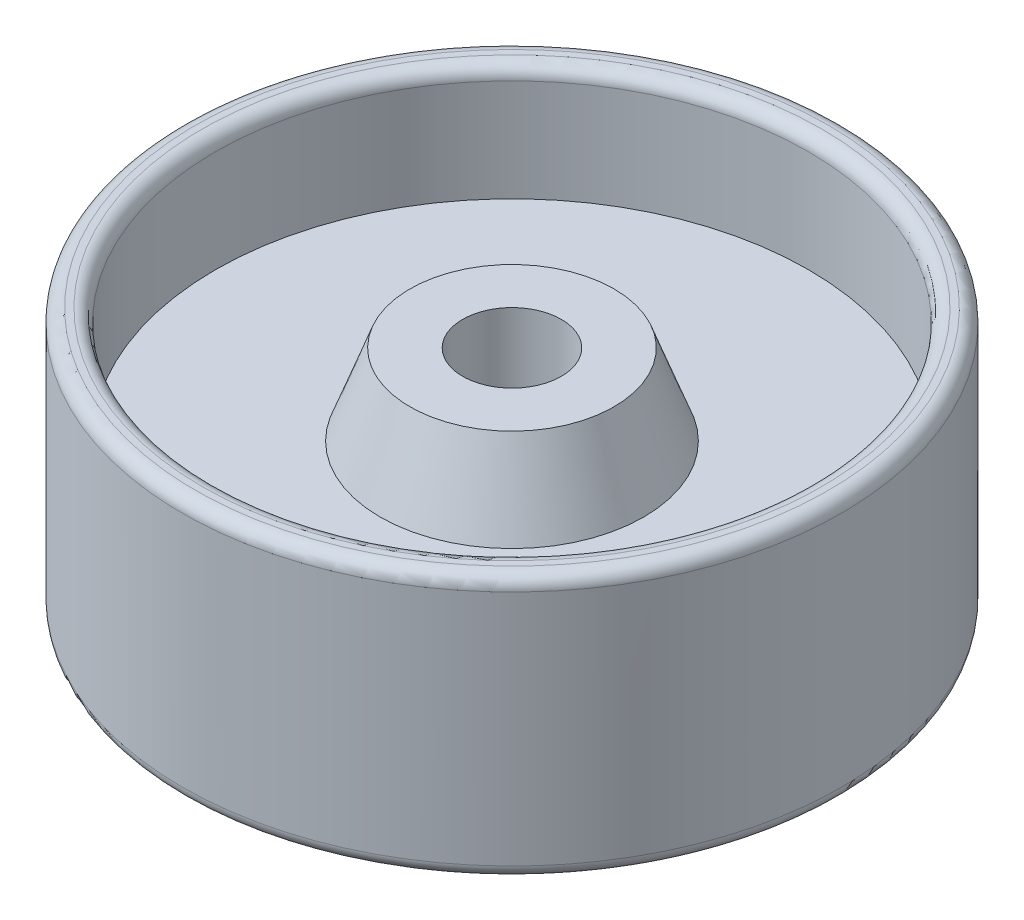
ISO-10303-21;
HEADER;
FILE_DESCRIPTION(('STEP AP214'),'2;1');
FILE_NAME('part.step','',(''),(''),'','','');
FILE_SCHEMA(('AUTOMOTIVE_DESIGN { 1 0 10303 214 1 1 1 1 }'));
ENDSEC;
DATA;
#1=APPLICATION_CONTEXT('core data for automotive mechanical design processes');
#2=APPLICATION_PROTOCOL_DEFINITION('international standard','automotive_design',2000,#1);
#3=PRODUCT_CONTEXT('',#1,'mechanical');
#4=PRODUCT('Part','Part','',(#3));
#5=PRODUCT_RELATED_PRODUCT_CATEGORY('part','',(#4));
#6=PRODUCT_DEFINITION_FORMATION('','',#4);
#7=PRODUCT_DEFINITION_CONTEXT('part definition',#1,'design');
#8=PRODUCT_DEFINITION('design','',#6,#7);
#9=PRODUCT_DEFINITION_SHAPE('','',#8);
#10=(LENGTH_UNIT() NAMED_UNIT(*) SI_UNIT(.MILLI.,.METRE.));
#11=(NAMED_UNIT(*) PLANE_ANGLE_UNIT() SI_UNIT($,.RADIAN.));
#12=(NAMED_UNIT(*) SI_UNIT($,.STERADIAN.) SOLID_ANGLE_UNIT());
#13=UNCERTAINTY_MEASURE_WITH_UNIT(LENGTH_MEASURE(1.E-05),#10,'distance_accuracy_value','');
#14=(GEOMETRIC_REPRESENTATION_CONTEXT(3) GLOBAL_UNCERTAINTY_ASSIGNED_CONTEXT((#13)) GLOBAL_UNIT_ASSIGNED_CONTEXT((#10,
#11,#12)) REPRESENTATION_CONTEXT('',''));
#15=CARTESIAN_POINT('',(0.,0.,0.));
#16=DIRECTION('',(0.,0.,1.));
#17=DIRECTION('',(1.,0.,0.));
#18=AXIS2_PLACEMENT_3D('',#15,#16,#17);
#19=CARTESIAN_POINT('',(0.,25.4,0.));
#20=DIRECTION('',(0.,-1.,0.));
#21=DIRECTION('',(0.,0.,-1.));
#22=AXIS2_PLACEMENT_3D('',#19,#20,#21);
#23=PLANE('',#22);
#24=CARTESIAN_POINT('',(63.5,25.4,0.));
#25=DIRECTION('',(0.,-1.,0.));
#26=DIRECTION('',(0.,0.,-1.));
#27=AXIS2_PLACEMENT_3D('',#24,#25,#26);
#28=CIRCLE('',#27,59.69);
#29=CARTESIAN_POINT('',(63.5,25.4,-59.69));
#30=VERTEX_POINT('',#29);
#31=EDGE_CURVE('E65',#30,#30,#28,.T.);
#32=ORIENTED_EDGE('',*,*,#31,.T.);
#33=EDGE_LOOP('',(#32));
#34=FACE_BOUND('',#33,.T.);
#35=CARTESIAN_POINT('',(63.5,25.4,0.));
#36=DIRECTION('',(0.,-1.,0.));
#37=DIRECTION('',(0.,0.,-1.));
#38=AXIS2_PLACEMENT_3D('',#35,#36,#37);
#39=CIRCLE('',#38,60.96);
#40=CARTESIAN_POINT('',(63.5,25.4,-60.96));
#41=VERTEX_POINT('',#40);
#42=EDGE_CURVE('E69',#41,#41,#39,.F.);
#43=ORIENTED_EDGE('',*,*,#42,.T.);
#44=EDGE_LOOP('',(#43));
#45=FACE_BOUND('',#44,.T.);
#46=ADVANCED_FACE('F41',(#34,#45),#23,.F.);
#47=CARTESIAN_POINT('',(63.5,0.,0.));
#48=DIRECTION('',(0.,-1.,0.));
#49=DIRECTION('',(0.,0.,-1.));
#50=AXIS2_PLACEMENT_3D('',#47,#48,#49);
#51=CYLINDRICAL_SURFACE('',#50,57.15);
#52=CARTESIAN_POINT('',(63.5,22.86,0.));
#53=DIRECTION('',(0.,-1.,0.));
#54=DIRECTION('',(0.,0.,-1.));
#55=AXIS2_PLACEMENT_3D('',#52,#53,#54);
#56=CIRCLE('',#55,57.15);
#57=CARTESIAN_POINT('',(63.5,22.86,-57.15));
#58=VERTEX_POINT('',#57);
#59=EDGE_CURVE('E59',#58,#58,#56,.F.);
#60=ORIENTED_EDGE('',*,*,#59,.T.);
#61=EDGE_LOOP('',(#60));
#62=FACE_BOUND('',#61,.T.);
#63=CARTESIAN_POINT('',(63.5,3.175,0.));
#64=DIRECTION('',(0.,-1.,0.));
#65=DIRECTION('',(0.,0.,-1.));
#66=AXIS2_PLACEMENT_3D('',#63,#64,#65);
#67=CIRCLE('',#66,57.15);
#68=CARTESIAN_POINT('',(63.5,3.175,-57.15));
#69=VERTEX_POINT('',#68);
#70=EDGE_CURVE('E73',#69,#69,#67,.T.);
#71=ORIENTED_EDGE('',*,*,#70,.T.);
#72=EDGE_LOOP('',(#71));
#73=FACE_BOUND('',#72,.T.);
#74=ADVANCED_FACE('F126',(#62,#73),#51,.F.);
#75=CARTESIAN_POINT('',(6.35,3.17500000000001,0.));
#76=DIRECTION('',(0.,-1.,0.));
#77=DIRECTION('',(0.,0.,-1.));
#78=AXIS2_PLACEMENT_3D('',#75,#76,#77);
#79=PLANE('',#78);
#80=ORIENTED_EDGE('',*,*,#70,.F.);
#81=EDGE_LOOP('',(#80));
#82=FACE_BOUND('',#81,.T.);
#83=CARTESIAN_POINT('',(63.5,3.17500000000001,0.));
#84=DIRECTION('',(0.,-1.,0.));
#85=DIRECTION('',(0.,0.,-1.));
#86=AXIS2_PLACEMENT_3D('',#83,#84,#85);
#87=CIRCLE('',#86,25.4);
#88=CARTESIAN_POINT('',(63.5,3.17500000000001,-25.4));
#89=VERTEX_POINT('',#88);
#90=EDGE_CURVE('E77',#89,#89,#87,.T.);
#91=ORIENTED_EDGE('',*,*,#90,.T.);
#92=EDGE_LOOP('',(#91));
#93=FACE_BOUND('',#92,.T.);
#94=ADVANCED_FACE('F132',(#82,#93),#79,.F.);
#95=CARTESIAN_POINT('',(63.5,18.7159459040965,0.));
#96=DIRECTION('',(0.,-1.,0.));
#97=DIRECTION('',(0.,0.,-1.));
#98=AXIS2_PLACEMENT_3D('',#95,#96,#97);
#99=CONICAL_SURFACE('',#98,19.6725181968748,0.353096339146461);
#100=ORIENTED_EDGE('',*,*,#90,.F.);
#101=EDGE_LOOP('',(#100));
#102=FACE_BOUND('',#101,.T.);
#103=CARTESIAN_POINT('',(63.5,18.7159459040965,0.));
#104=DIRECTION('',(0.,-1.,0.));
#105=DIRECTION('',(0.,0.,-1.));
#106=AXIS2_PLACEMENT_3D('',#103,#104,#105);
#107=CIRCLE('',#106,19.6725181968748);
#108=CARTESIAN_POINT('',(63.5,18.7159459040965,-19.6725181968748));
#109=VERTEX_POINT('',#108);
#110=EDGE_CURVE('E81',#109,#109,#107,.T.);
#111=ORIENTED_EDGE('',*,*,#110,.T.);
#112=EDGE_LOOP('',(#111));
#113=FACE_BOUND('',#112,.T.);
#114=ADVANCED_FACE('F253',(#102,#113),#99,.T.);
#115=CARTESIAN_POINT('',(43.8274818031252,18.7159459040965,0.));
#116=DIRECTION('',(0.,-1.,0.));
#117=DIRECTION('',(0.,0.,-1.));
#118=AXIS2_PLACEMENT_3D('',#115,#116,#117);
#119=PLANE('',#118);
#120=ORIENTED_EDGE('',*,*,#110,.F.);
#121=EDGE_LOOP('',(#120));
#122=FACE_BOUND('',#121,.T.);
#123=CARTESIAN_POINT('',(63.5,18.7159459040965,0.));
#124=DIRECTION('',(0.,-1.,0.));
#125=DIRECTION('',(0.,0.,-1.));
#126=AXIS2_PLACEMENT_3D('',#123,#124,#125);
#127=CIRCLE('',#126,9.51251819687483);
#128=CARTESIAN_POINT('',(63.5,18.7159459040965,-9.51251819687483));
#129=VERTEX_POINT('',#128);
#130=EDGE_CURVE('E85',#129,#129,#127,.T.);
#131=ORIENTED_EDGE('',*,*,#130,.T.);
#132=EDGE_LOOP('',(#131));
#133=FACE_BOUND('',#132,.T.);
#134=ADVANCED_FACE('F242',(#122,#133),#119,.F.);
#135=CARTESIAN_POINT('',(63.5,0.,0.));
#136=DIRECTION('',(0.,-1.,0.));
#137=DIRECTION('',(0.,0.,-1.));
#138=AXIS2_PLACEMENT_3D('',#135,#136,#137);
#139=CYLINDRICAL_SURFACE('',#138,9.51251819687483);
#140=ORIENTED_EDGE('',*,*,#130,.F.);
#141=EDGE_LOOP('',(#140));
#142=FACE_BOUND('',#141,.T.);
#143=CARTESIAN_POINT('',(63.5,-18.7159459040965,0.));
#144=DIRECTION('',(0.,-1.,0.));
#145=DIRECTION('',(0.,0.,-1.));
#146=AXIS2_PLACEMENT_3D('',#143,#144,#145);
#147=CIRCLE('',#146,9.51251819687483);
#148=CARTESIAN_POINT('',(63.5,-18.7159459040965,-9.51251819687483));
#149=VERTEX_POINT('',#148);
#150=EDGE_CURVE('E89',#149,#149,#147,.T.);
#151=ORIENTED_EDGE('',*,*,#150,.T.);
#152=EDGE_LOOP('',(#151));
#153=FACE_BOUND('',#152,.T.);
#154=ADVANCED_FACE('F231',(#142,#153),#139,.F.);
#155=CARTESIAN_POINT('',(43.1495594223311,-18.7159459040965,0.));
#156=DIRECTION('',(0.,1.,0.));
#157=DIRECTION('',(0.,0.,1.));
#158=AXIS2_PLACEMENT_3D('',#155,#156,#157);
#159=PLANE('',#158);
#160=ORIENTED_EDGE('',*,*,#150,.F.);
#161=EDGE_LOOP('',(#160));
#162=FACE_BOUND('',#161,.T.);
#163=CARTESIAN_POINT('',(63.5,-18.7159459040965,0.));
#164=DIRECTION('',(0.,-1.,0.));
#165=DIRECTION('',(0.,0.,-1.));
#166=AXIS2_PLACEMENT_3D('',#163,#164,#165);
#167=CIRCLE('',#166,20.3504405776689);
#168=CARTESIAN_POINT('',(63.5,-18.7159459040965,-20.3504405776689));
#169=VERTEX_POINT('',#168);
#170=EDGE_CURVE('E93',#169,#169,#167,.T.);
#171=ORIENTED_EDGE('',*,*,#170,.T.);
#172=EDGE_LOOP('',(#171));
#173=FACE_BOUND('',#172,.T.);
#174=ADVANCED_FACE('F220',(#162,#173),#159,.F.);
#175=CARTESIAN_POINT('',(63.5,-3.17499999999999,0.));
#176=DIRECTION('',(0.,1.,0.));
#177=DIRECTION('',(0.,0.,1.));
#178=AXIS2_PLACEMENT_3D('',#175,#176,#177);
#179=CONICAL_SURFACE('',#178,25.4,0.314159265358981);
#180=ORIENTED_EDGE('',*,*,#170,.F.);
#181=EDGE_LOOP('',(#180));
#182=FACE_BOUND('',#181,.T.);
#183=CARTESIAN_POINT('',(63.5,-3.17499999999999,0.));
#184=DIRECTION('',(0.,-1.,0.));
#185=DIRECTION('',(0.,0.,-1.));
#186=AXIS2_PLACEMENT_3D('',#183,#184,#185);
#187=CIRCLE('',#186,25.4);
#188=CARTESIAN_POINT('',(63.5,-3.17499999999999,-25.4));
#189=VERTEX_POINT('',#188);
#190=EDGE_CURVE('E97',#189,#189,#187,.T.);
#191=ORIENTED_EDGE('',*,*,#190,.T.);
#192=EDGE_LOOP('',(#191));
#193=FACE_BOUND('',#192,.T.);
#194=ADVANCED_FACE('F209',(#182,#193),#179,.T.);
#195=CARTESIAN_POINT('',(6.35,-3.175,0.));
#196=DIRECTION('',(0.,1.,0.));
#197=DIRECTION('',(0.,0.,1.));
#198=AXIS2_PLACEMENT_3D('',#195,#196,#197);
#199=PLANE('',#198);
#200=ORIENTED_EDGE('',*,*,#190,.F.);
#201=EDGE_LOOP('',(#200));
#202=FACE_BOUND('',#201,.T.);
#203=CARTESIAN_POINT('',(63.5,-3.175,0.));
#204=DIRECTION('',(0.,-1.,0.));
#205=DIRECTION('',(0.,0.,-1.));
#206=AXIS2_PLACEMENT_3D('',#203,#204,#205);
#207=CIRCLE('',#206,57.15);
#208=CARTESIAN_POINT('',(63.5,-3.175,-57.15));
#209=VERTEX_POINT('',#208);
#210=EDGE_CURVE('E101',#209,#209,#207,.T.);
#211=ORIENTED_EDGE('',*,*,#210,.T.);
#212=EDGE_LOOP('',(#211));
#213=FACE_BOUND('',#212,.T.);
#214=ADVANCED_FACE('F122',(#202,#213),#199,.F.);
#215=CARTESIAN_POINT('',(63.5,0.,0.));
#216=DIRECTION('',(0.,-1.,0.));
#217=DIRECTION('',(0.,0.,-1.));
#218=AXIS2_PLACEMENT_3D('',#215,#216,#217);
#219=CYLINDRICAL_SURFACE('',#218,57.15);
#220=ORIENTED_EDGE('',*,*,#210,.F.);
#221=EDGE_LOOP('',(#220));
#222=FACE_BOUND('',#221,.T.);
#223=CARTESIAN_POINT('',(63.5,-25.4,0.));
#224=DIRECTION('',(0.,-1.,0.));
#225=DIRECTION('',(0.,0.,-1.));
#226=AXIS2_PLACEMENT_3D('',#223,#224,#225);
#227=CIRCLE('',#226,57.15);
#228=CARTESIAN_POINT('',(63.5,-25.4,-57.15));
#229=VERTEX_POINT('',#228);
#230=EDGE_CURVE('E105',#229,#229,#227,.T.);
#231=ORIENTED_EDGE('',*,*,#230,.T.);
#232=EDGE_LOOP('',(#231));
#233=FACE_BOUND('',#232,.T.);
#234=ADVANCED_FACE('F110',(#222,#233),#219,.F.);
#235=CARTESIAN_POINT('',(0.,-25.4,0.));
#236=DIRECTION('',(0.,1.,0.));
#237=DIRECTION('',(0.,0.,1.));
#238=AXIS2_PLACEMENT_3D('',#235,#236,#237);
#239=PLANE('',#238);
#240=CARTESIAN_POINT('',(63.5,-25.4,0.));
#241=DIRECTION('',(0.,1.,0.));
#242=DIRECTION('',(0.,0.,1.));
#243=AXIS2_PLACEMENT_3D('',#240,#241,#242);
#244=CIRCLE('',#243,60.96);
#245=CARTESIAN_POINT('',(63.5,-25.4,60.96));
#246=VERTEX_POINT('',#245);
#247=EDGE_CURVE('E10',#246,#246,#244,.F.);
#248=ORIENTED_EDGE('',*,*,#247,.T.);
#249=EDGE_LOOP('',(#248));
#250=FACE_BOUND('',#249,.T.);
#251=ORIENTED_EDGE('',*,*,#230,.F.);
#252=EDGE_LOOP('',(#251));
#253=FACE_BOUND('',#252,.T.);
#254=ADVANCED_FACE('F112',(#250,#253),#239,.F.);
#255=CARTESIAN_POINT('',(63.5,0.,0.));
#256=DIRECTION('',(0.,-1.,0.));
#257=DIRECTION('',(0.,0.,-1.));
#258=AXIS2_PLACEMENT_3D('',#255,#256,#257);
#259=CYLINDRICAL_SURFACE('',#258,63.5);
#260=CARTESIAN_POINT('',(63.5,22.86,0.));
#261=DIRECTION('',(0.,-1.,0.));
#262=DIRECTION('',(0.,0.,-1.));
#263=AXIS2_PLACEMENT_3D('',#260,#261,#262);
#264=CIRCLE('',#263,63.5);
#265=CARTESIAN_POINT('',(63.5,22.86,-63.5));
#266=VERTEX_POINT('',#265);
#267=EDGE_CURVE('E49',#266,#266,#264,.T.);
#268=ORIENTED_EDGE('',*,*,#267,.T.);
#269=EDGE_LOOP('',(#268));
#270=FACE_BOUND('',#269,.T.);
#271=CARTESIAN_POINT('',(63.5,-22.86,0.));
#272=DIRECTION('',(0.,1.,0.));
#273=DIRECTION('',(0.,0.,1.));
#274=AXIS2_PLACEMENT_3D('',#271,#272,#273);
#275=CIRCLE('',#274,63.5);
#276=CARTESIAN_POINT('',(63.5,-22.86,63.5));
#277=VERTEX_POINT('',#276);
#278=EDGE_CURVE('E54',#277,#277,#275,.T.);
#279=ORIENTED_EDGE('',*,*,#278,.T.);
#280=EDGE_LOOP('',(#279));
#281=FACE_BOUND('',#280,.T.);
#282=ADVANCED_FACE('F114',(#270,#281),#259,.T.);
#283=CARTESIAN_POINT('',(63.5,22.86,0.));
#284=DIRECTION('',(0.,-1.,0.));
#285=DIRECTION('',(0.,0.,-1.));
#286=AXIS2_PLACEMENT_3D('',#283,#284,#285);
#287=TOROIDAL_SURFACE('',#286,59.69,2.54);
#288=ORIENTED_EDGE('',*,*,#59,.F.);
#289=EDGE_LOOP('',(#288));
#290=FACE_BOUND('',#289,.T.);
#291=ORIENTED_EDGE('',*,*,#31,.F.);
#292=EDGE_LOOP('',(#291));
#293=FACE_BOUND('',#292,.T.);
#294=ADVANCED_FACE('F120',(#290,#293),#287,.T.);
#295=CARTESIAN_POINT('',(63.5,22.86,0.));
#296=DIRECTION('',(0.,-1.,0.));
#297=DIRECTION('',(0.,0.,-1.));
#298=AXIS2_PLACEMENT_3D('',#295,#296,#297);
#299=TOROIDAL_SURFACE('',#298,60.96,2.54);
#300=ORIENTED_EDGE('',*,*,#42,.F.);
#301=EDGE_LOOP('',(#300));
#302=FACE_BOUND('',#301,.T.);
#303=ORIENTED_EDGE('',*,*,#267,.F.);
#304=EDGE_LOOP('',(#303));
#305=FACE_BOUND('',#304,.T.);
#306=ADVANCED_FACE('F139',(#302,#305),#299,.T.);
#307=CARTESIAN_POINT('',(63.5,-22.86,0.));
#308=DIRECTION('',(0.,1.,0.));
#309=DIRECTION('',(0.,0.,1.));
#310=AXIS2_PLACEMENT_3D('',#307,#308,#309);
#311=TOROIDAL_SURFACE('',#310,60.96,2.54);
#312=ORIENTED_EDGE('',*,*,#278,.F.);
#313=EDGE_LOOP('',(#312));
#314=FACE_BOUND('',#313,.T.);
#315=ORIENTED_EDGE('',*,*,#247,.F.);
#316=EDGE_LOOP('',(#315));
#317=FACE_BOUND('',#316,.T.);
#318=ADVANCED_FACE('F43',(#314,#317),#311,.T.);
#319=CLOSED_SHELL('',(#46,#74,#94,#114,#134,#154,#174,#194,#214,#234,#254,#282,#294,#306,#318));
#320=MANIFOLD_SOLID_BREP('B2',#319);
#321=ADVANCED_BREP_SHAPE_REPRESENTATION('',(#18,#320),#14);
#322=SHAPE_DEFINITION_REPRESENTATION(#9,#321);
ENDSEC;
END-ISO-10303-21;
